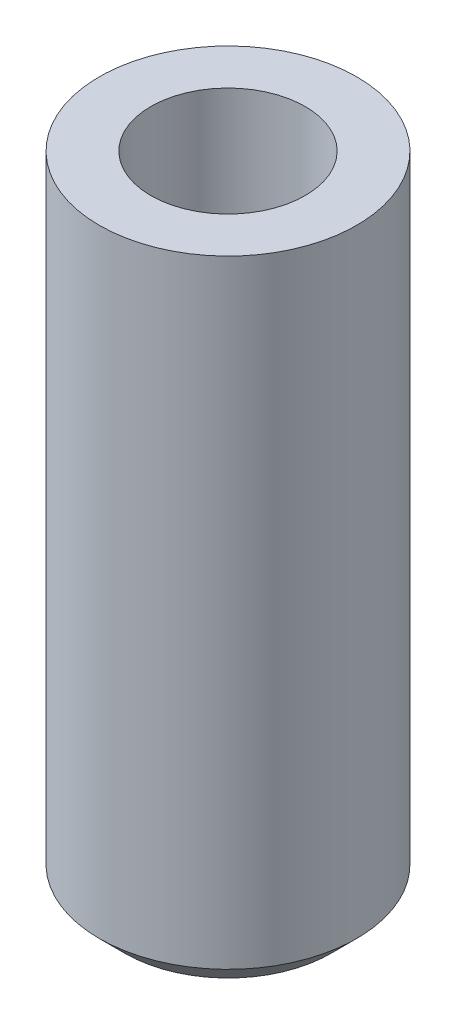
ISO-10303-21;
HEADER;
FILE_DESCRIPTION(('STEP AP214'),'2;1');
FILE_NAME('part.step','',(''),(''),'','','');
FILE_SCHEMA(('AUTOMOTIVE_DESIGN { 1 0 10303 214 1 1 1 1 }'));
ENDSEC;
DATA;
#1=APPLICATION_CONTEXT('core data for automotive mechanical design processes');
#2=APPLICATION_PROTOCOL_DEFINITION('international standard','automotive_design',2000,#1);
#3=PRODUCT_CONTEXT('',#1,'mechanical');
#4=PRODUCT('Part','Part','',(#3));
#5=PRODUCT_RELATED_PRODUCT_CATEGORY('part','',(#4));
#6=PRODUCT_DEFINITION_FORMATION('','',#4);
#7=PRODUCT_DEFINITION_CONTEXT('part definition',#1,'design');
#8=PRODUCT_DEFINITION('design','',#6,#7);
#9=PRODUCT_DEFINITION_SHAPE('','',#8);
#10=(LENGTH_UNIT() NAMED_UNIT(*) SI_UNIT(.MILLI.,.METRE.));
#11=(NAMED_UNIT(*) PLANE_ANGLE_UNIT() SI_UNIT($,.RADIAN.));
#12=(NAMED_UNIT(*) SI_UNIT($,.STERADIAN.) SOLID_ANGLE_UNIT());
#13=UNCERTAINTY_MEASURE_WITH_UNIT(LENGTH_MEASURE(1.E-05),#10,'distance_accuracy_value','');
#14=(GEOMETRIC_REPRESENTATION_CONTEXT(3) GLOBAL_UNCERTAINTY_ASSIGNED_CONTEXT((#13)) GLOBAL_UNIT_ASSIGNED_CONTEXT((#10,
#11,#12)) REPRESENTATION_CONTEXT('',''));
#15=CARTESIAN_POINT('',(0.,0.,0.));
#16=DIRECTION('',(0.,0.,1.));
#17=DIRECTION('',(1.,0.,0.));
#18=AXIS2_PLACEMENT_3D('',#15,#16,#17);
#19=CARTESIAN_POINT('',(0.,0.,0.));
#20=DIRECTION('',(0.,1.,0.));
#21=DIRECTION('',(0.,0.,1.));
#22=AXIS2_PLACEMENT_3D('',#19,#20,#21);
#23=PLANE('',#22);
#24=CARTESIAN_POINT('',(0.,0.,0.));
#25=DIRECTION('',(0.,1.,0.));
#26=DIRECTION('',(0.,0.,1.));
#27=AXIS2_PLACEMENT_3D('',#24,#25,#26);
#28=CIRCLE('',#27,1.5);
#29=CARTESIAN_POINT('',(0.,0.,1.5));
#30=VERTEX_POINT('',#29);
#31=EDGE_CURVE('E56',#30,#30,#28,.T.);
#32=ORIENTED_EDGE('',*,*,#31,.T.);
#33=EDGE_LOOP('',(#32));
#34=FACE_BOUND('',#33,.T.);
#35=CARTESIAN_POINT('',(0.,0.,0.));
#36=DIRECTION('',(0.,1.,0.));
#37=DIRECTION('',(0.,0.,1.));
#38=AXIS2_PLACEMENT_3D('',#35,#36,#37);
#39=CIRCLE('',#38,4.);
#40=CARTESIAN_POINT('',(0.,0.,4.));
#41=VERTEX_POINT('',#40);
#42=EDGE_CURVE('E10',#41,#41,#39,.T.);
#43=ORIENTED_EDGE('',*,*,#42,.F.);
#44=EDGE_LOOP('',(#43));
#45=FACE_BOUND('',#44,.T.);
#46=ADVANCED_FACE('F34',(#34,#45),#23,.F.);
#47=CARTESIAN_POINT('',(0.,0.,0.));
#48=DIRECTION('',(0.,1.,0.));
#49=DIRECTION('',(0.,0.,1.));
#50=AXIS2_PLACEMENT_3D('',#47,#48,#49);
#51=CONICAL_SURFACE('',#50,4.,0.785398163397446);
#52=CARTESIAN_POINT('',(0.,1.,0.));
#53=DIRECTION('',(0.,1.,0.));
#54=DIRECTION('',(0.,0.,1.));
#55=AXIS2_PLACEMENT_3D('',#52,#53,#54);
#56=CIRCLE('',#55,5.);
#57=CARTESIAN_POINT('',(0.,1.,5.));
#58=VERTEX_POINT('',#57);
#59=EDGE_CURVE('E41',#58,#58,#56,.T.);
#60=ORIENTED_EDGE('',*,*,#59,.F.);
#61=EDGE_LOOP('',(#60));
#62=FACE_BOUND('',#61,.T.);
#63=ORIENTED_EDGE('',*,*,#42,.T.);
#64=EDGE_LOOP('',(#63));
#65=FACE_BOUND('',#64,.T.);
#66=ADVANCED_FACE('F77',(#62,#65),#51,.T.);
#67=CARTESIAN_POINT('',(0.,31.4442289213162,0.));
#68=DIRECTION('',(0.,1.,0.));
#69=DIRECTION('',(0.,0.,1.));
#70=AXIS2_PLACEMENT_3D('',#67,#68,#69);
#71=CYLINDRICAL_SURFACE('',#70,5.);
#72=CARTESIAN_POINT('',(0.,25.,0.));
#73=DIRECTION('',(0.,1.,0.));
#74=DIRECTION('',(0.,0.,1.));
#75=AXIS2_PLACEMENT_3D('',#72,#73,#74);
#76=CIRCLE('',#75,5.);
#77=CARTESIAN_POINT('',(0.,25.,5.));
#78=VERTEX_POINT('',#77);
#79=EDGE_CURVE('E45',#78,#78,#76,.T.);
#80=ORIENTED_EDGE('',*,*,#79,.F.);
#81=EDGE_LOOP('',(#80));
#82=FACE_BOUND('',#81,.T.);
#83=ORIENTED_EDGE('',*,*,#59,.T.);
#84=EDGE_LOOP('',(#83));
#85=FACE_BOUND('',#84,.T.);
#86=ADVANCED_FACE('F81',(#82,#85),#71,.T.);
#87=CARTESIAN_POINT('',(5.,25.,0.));
#88=DIRECTION('',(0.,-1.,0.));
#89=DIRECTION('',(0.,0.,-1.));
#90=AXIS2_PLACEMENT_3D('',#87,#88,#89);
#91=PLANE('',#90);
#92=CARTESIAN_POINT('',(0.,25.,0.));
#93=DIRECTION('',(0.,1.,0.));
#94=DIRECTION('',(0.,0.,1.));
#95=AXIS2_PLACEMENT_3D('',#92,#93,#94);
#96=CIRCLE('',#95,3.);
#97=CARTESIAN_POINT('',(0.,25.,3.));
#98=VERTEX_POINT('',#97);
#99=EDGE_CURVE('E53',#98,#98,#96,.T.);
#100=ORIENTED_EDGE('',*,*,#99,.F.);
#101=EDGE_LOOP('',(#100));
#102=FACE_BOUND('',#101,.T.);
#103=ORIENTED_EDGE('',*,*,#79,.T.);
#104=EDGE_LOOP('',(#103));
#105=FACE_BOUND('',#104,.T.);
#106=ADVANCED_FACE('F87',(#102,#105),#91,.F.);
#107=CARTESIAN_POINT('',(0.,5.,0.));
#108=DIRECTION('',(0.,1.,0.));
#109=DIRECTION('',(0.,0.,1.));
#110=AXIS2_PLACEMENT_3D('',#107,#108,#109);
#111=CONICAL_SURFACE('',#110,3.,1.02974425867665);
#112=CARTESIAN_POINT('',(0.,4.09870907145866,0.));
#113=DIRECTION('',(0.,1.,0.));
#114=DIRECTION('',(0.,0.,1.));
#115=AXIS2_PLACEMENT_3D('',#112,#113,#114);
#116=CIRCLE('',#115,1.5);
#117=CARTESIAN_POINT('',(0.,4.09870907145866,1.5));
#118=VERTEX_POINT('',#117);
#119=EDGE_CURVE('E37',#118,#118,#116,.F.);
#120=ORIENTED_EDGE('',*,*,#119,.T.);
#121=EDGE_LOOP('',(#120));
#122=FACE_BOUND('',#121,.T.);
#123=CARTESIAN_POINT('',(0.,5.,0.));
#124=DIRECTION('',(0.,1.,0.));
#125=DIRECTION('',(0.,0.,1.));
#126=AXIS2_PLACEMENT_3D('',#123,#124,#125);
#127=CIRCLE('',#126,3.);
#128=CARTESIAN_POINT('',(0.,5.,3.));
#129=VERTEX_POINT('',#128);
#130=EDGE_CURVE('E50',#129,#129,#127,.T.);
#131=ORIENTED_EDGE('',*,*,#130,.T.);
#132=EDGE_LOOP('',(#131));
#133=FACE_BOUND('',#132,.T.);
#134=ADVANCED_FACE('F63',(#122,#133),#111,.F.);
#135=CARTESIAN_POINT('',(0.,25.,0.));
#136=DIRECTION('',(0.,1.,0.));
#137=DIRECTION('',(0.,0.,1.));
#138=AXIS2_PLACEMENT_3D('',#135,#136,#137);
#139=CYLINDRICAL_SURFACE('',#138,3.);
#140=ORIENTED_EDGE('',*,*,#130,.F.);
#141=EDGE_LOOP('',(#140));
#142=FACE_BOUND('',#141,.T.);
#143=ORIENTED_EDGE('',*,*,#99,.T.);
#144=EDGE_LOOP('',(#143));
#145=FACE_BOUND('',#144,.T.);
#146=ADVANCED_FACE('F68',(#142,#145),#139,.F.);
#147=CARTESIAN_POINT('',(0.,0.,0.));
#148=DIRECTION('',(0.,1.,0.));
#149=DIRECTION('',(0.,0.,1.));
#150=AXIS2_PLACEMENT_3D('',#147,#148,#149);
#151=CYLINDRICAL_SURFACE('',#150,1.5);
#152=ORIENTED_EDGE('',*,*,#31,.F.);
#153=EDGE_LOOP('',(#152));
#154=FACE_BOUND('',#153,.T.);
#155=ORIENTED_EDGE('',*,*,#119,.F.);
#156=EDGE_LOOP('',(#155));
#157=FACE_BOUND('',#156,.T.);
#158=ADVANCED_FACE('F66',(#154,#157),#151,.F.);
#159=CLOSED_SHELL('',(#46,#66,#86,#106,#134,#146,#158));
#160=MANIFOLD_SOLID_BREP('B2',#159);
#161=ADVANCED_BREP_SHAPE_REPRESENTATION('',(#18,#160),#14);
#162=SHAPE_DEFINITION_REPRESENTATION(#9,#161);
ENDSEC;
END-ISO-10303-21;
